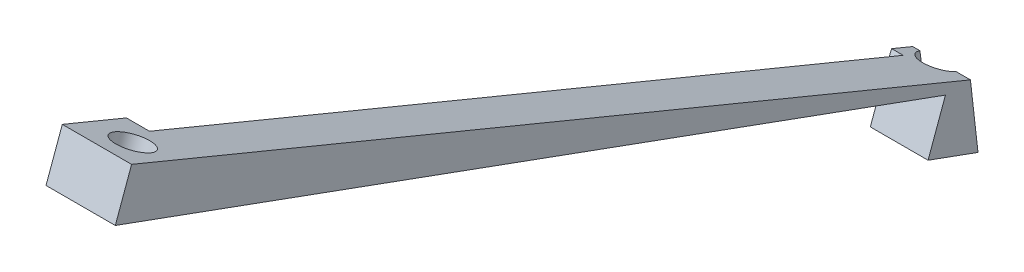
ISO-10303-21;
HEADER;
FILE_DESCRIPTION(('STEP AP214'),'2;1');
FILE_NAME('part.step','',(''),(''),'','','');
FILE_SCHEMA(('AUTOMOTIVE_DESIGN { 1 0 10303 214 1 1 1 1 }'));
ENDSEC;
DATA;
#1=APPLICATION_CONTEXT('core data for automotive mechanical design processes');
#2=APPLICATION_PROTOCOL_DEFINITION('international standard','automotive_design',2000,#1);
#3=PRODUCT_CONTEXT('',#1,'mechanical');
#4=PRODUCT('Part','Part','',(#3));
#5=PRODUCT_RELATED_PRODUCT_CATEGORY('part','',(#4));
#6=PRODUCT_DEFINITION_FORMATION('','',#4);
#7=PRODUCT_DEFINITION_CONTEXT('part definition',#1,'design');
#8=PRODUCT_DEFINITION('design','',#6,#7);
#9=PRODUCT_DEFINITION_SHAPE('','',#8);
#10=(LENGTH_UNIT() NAMED_UNIT(*) SI_UNIT(.MILLI.,.METRE.));
#11=(NAMED_UNIT(*) PLANE_ANGLE_UNIT() SI_UNIT($,.RADIAN.));
#12=(NAMED_UNIT(*) SI_UNIT($,.STERADIAN.) SOLID_ANGLE_UNIT());
#13=UNCERTAINTY_MEASURE_WITH_UNIT(LENGTH_MEASURE(1.E-05),#10,'distance_accuracy_value','');
#14=(GEOMETRIC_REPRESENTATION_CONTEXT(3) GLOBAL_UNCERTAINTY_ASSIGNED_CONTEXT((#13)) GLOBAL_UNIT_ASSIGNED_CONTEXT((#10,
#11,#12)) REPRESENTATION_CONTEXT('',''));
#15=CARTESIAN_POINT('',(0.,0.,0.));
#16=DIRECTION('',(0.,0.,1.));
#17=DIRECTION('',(1.,0.,0.));
#18=AXIS2_PLACEMENT_3D('',#15,#16,#17);
#19=CARTESIAN_POINT('',(8.,-35.7473202159316,-74.6958322749875));
#20=DIRECTION('',(0.,-0.112876155748174,0.993609064704783));
#21=DIRECTION('',(0.,-0.993609064704783,-0.112876155748174));
#22=AXIS2_PLACEMENT_3D('',#19,#20,#21);
#23=PLANE('',#22);
#24=CARTESIAN_POINT('',(2.39421739533138,-24.8225562297524,-73.4547552709423));
#25=DIRECTION('',(0.,-0.112876155748174,0.993609064704783));
#26=DIRECTION('',(0.,0.993609064704783,0.112876155748174));
#27=AXIS2_PLACEMENT_3D('',#24,#25,#26);
#28=ELLIPSE('',#27,7.06417920673511,3.14994015137412);
#29=CARTESIAN_POINT('',(5.53206577291514,-24.2081311688942,-73.3849552446254));
#30=VERTEX_POINT('',#29);
#31=CARTESIAN_POINT('',(4.29539750685049,-30.4189504776165,-74.0905178572445));
#32=VERTEX_POINT('',#31);
#33=EDGE_CURVE('E121',#30,#32,#28,.F.);
#34=ORIENTED_EDGE('',*,*,#33,.F.);
#35=DIRECTION('',(-1.,0.,0.));
#36=VECTOR('',#35,1.);
#37=CARTESIAN_POINT('',(8.,-24.2081311688942,-73.3849552446254));
#38=LINE('',#37,#36);
#39=CARTESIAN_POINT('',(8.,-24.2081311688942,-73.3849552446254));
#40=VERTEX_POINT('',#39);
#41=EDGE_CURVE('E205',#40,#30,#38,.T.);
#42=ORIENTED_EDGE('',*,*,#41,.F.);
#43=DIRECTION('',(0.,0.993609064704783,0.112876155748174));
#44=VECTOR('',#43,1.);
#45=CARTESIAN_POINT('',(8.,-35.7473202159316,-74.6958322749875));
#46=LINE('',#45,#44);
#47=CARTESIAN_POINT('',(8.,-35.7473202159316,-74.6958322749875));
#48=VERTEX_POINT('',#47);
#49=EDGE_CURVE('E191',#48,#40,#46,.T.);
#50=ORIENTED_EDGE('',*,*,#49,.F.);
#51=DIRECTION('',(-1.,0.,0.));
#52=VECTOR('',#51,1.);
#53=CARTESIAN_POINT('',(8.,-35.7473202159316,-74.6958322749875));
#54=LINE('',#53,#52);
#55=CARTESIAN_POINT('',(-2.,-35.7473202159316,-74.6958322749875));
#56=VERTEX_POINT('',#55);
#57=EDGE_CURVE('E207',#48,#56,#54,.T.);
#58=ORIENTED_EDGE('',*,*,#57,.T.);
#59=DIRECTION('',(0.,-0.993609064704783,-0.112876155748174));
#60=VECTOR('',#59,1.);
#61=CARTESIAN_POINT('',(-2.,-25.978642362354,-73.5860891757921));
#62=LINE('',#61,#60);
#63=CARTESIAN_POINT('',(-2.,-24.2081311688942,-73.3849552446254));
#64=VERTEX_POINT('',#63);
#65=EDGE_CURVE('E146',#64,#56,#62,.T.);
#66=ORIENTED_EDGE('',*,*,#65,.F.);
#67=CARTESIAN_POINT('',(-0.743630982252375,-24.2081311688942,-73.3849552446254));
#68=VERTEX_POINT('',#67);
#69=EDGE_CURVE('E204',#68,#64,#38,.T.);
#70=ORIENTED_EDGE('',*,*,#69,.F.);
#71=CARTESIAN_POINT('',(0.493037283812277,-30.4189504776165,-74.0905178572445));
#72=VERTEX_POINT('',#71);
#73=EDGE_CURVE('E49',#72,#68,#28,.F.);
#74=ORIENTED_EDGE('',*,*,#73,.F.);
#75=DIRECTION('',(1.,0.,0.));
#76=VECTOR('',#75,1.);
#77=CARTESIAN_POINT('',(8.,-30.4189504776165,-74.0905178572445));
#78=LINE('',#77,#76);
#79=EDGE_CURVE('E133',#72,#32,#78,.T.);
#80=ORIENTED_EDGE('',*,*,#79,.T.);
#81=EDGE_LOOP('',(#34,#42,#50,#58,#66,#70,#74,#80));
#82=FACE_BOUND('',#81,.T.);
#83=ADVANCED_FACE('F35',(#82),#23,.F.);
#84=CARTESIAN_POINT('',(0.,0.,0.));
#85=DIRECTION('',(-1.,0.,0.));
#86=DIRECTION('',(0.,0.,1.));
#87=AXIS2_PLACEMENT_3D('',#84,#85,#86);
#88=PLANE('',#87);
#89=DIRECTION('',(0.,0.381529725255829,0.924356570132009));
#90=VECTOR('',#89,1.);
#91=CARTESIAN_POINT('',(0.,35.7473202159316,71.8729676226761));
#92=LINE('',#91,#90);
#93=CARTESIAN_POINT('',(0.,-22.7009550134963,-69.7334227705719));
#94=VERTEX_POINT('',#93);
#95=CARTESIAN_POINT('',(0.,31.1648479910877,60.77071784216));
#96=VERTEX_POINT('',#95);
#97=EDGE_CURVE('E57',#94,#96,#92,.T.);
#98=ORIENTED_EDGE('',*,*,#97,.F.);
#99=DIRECTION('',(0.,0.924356570132008,-0.38152972525583));
#100=VECTOR('',#99,1.);
#101=CARTESIAN_POINT('',(0.,-24.3314398344194,-69.0604374250231));
#102=LINE('',#101,#100);
#103=CARTESIAN_POINT('',(0.,-24.3314398344194,-69.0604374250231));
#104=VERTEX_POINT('',#103);
#105=EDGE_CURVE('E145',#104,#94,#102,.T.);
#106=ORIENTED_EDGE('',*,*,#105,.F.);
#107=DIRECTION('',(0.,-0.342020143325673,-0.939692620785907));
#108=VECTOR('',#107,1.);
#109=CARTESIAN_POINT('',(0.,27.9915633255296,74.6958322749875));
#110=LINE('',#109,#108);
#111=CARTESIAN_POINT('',(0.,23.8873216056215,63.4195208255566));
#112=VERTEX_POINT('',#111);
#113=EDGE_CURVE('E183',#112,#104,#110,.T.);
#114=ORIENTED_EDGE('',*,*,#113,.F.);
#115=DIRECTION('',(0.,-0.939692620785906,0.342020143325675));
#116=VECTOR('',#115,1.);
#117=CARTESIAN_POINT('',(0.,23.8873216056215,63.4195208255566));
#118=LINE('',#117,#116);
#119=EDGE_CURVE('E164',#96,#112,#118,.T.);
#120=ORIENTED_EDGE('',*,*,#119,.F.);
#121=EDGE_LOOP('',(#98,#106,#114,#120));
#122=FACE_BOUND('',#121,.T.);
#123=ADVANCED_FACE('F229',(#122),#88,.T.);
#124=CARTESIAN_POINT('',(8.,27.9915633255296,74.6958322749875));
#125=DIRECTION('',(0.,0.939692620785907,-0.342020143325673));
#126=DIRECTION('',(0.,0.342020143325673,0.939692620785907));
#127=AXIS2_PLACEMENT_3D('',#124,#125,#126);
#128=PLANE('',#127);
#129=CARTESIAN_POINT('',(2.39421739533138,25.8438455706848,68.7950262401898));
#130=DIRECTION('',(0.,0.939692620785907,-0.342020143325673));
#131=DIRECTION('',(0.,0.342020143325673,0.939692620785907));
#132=AXIS2_PLACEMENT_3D('',#129,#130,#131);
#133=CIRCLE('',#132,3.14994015137412);
#134=CARTESIAN_POINT('',(2.39421739533138,26.9211885527251,71.7550017563533));
#135=VERTEX_POINT('',#134);
#136=EDGE_CURVE('E134',#135,#135,#133,.F.);
#137=ORIENTED_EDGE('',*,*,#136,.F.);
#138=EDGE_LOOP('',(#137));
#139=FACE_BOUND('',#138,.T.);
#140=DIRECTION('',(-1.,0.,0.));
#141=VECTOR('',#140,1.);
#142=CARTESIAN_POINT('',(8.,27.9915633255296,74.6958322749875));
#143=LINE('',#142,#141);
#144=CARTESIAN_POINT('',(8.,27.9915633255296,74.6958322749875));
#145=VERTEX_POINT('',#144);
#146=CARTESIAN_POINT('',(-4.,27.9915633255296,74.6958322749875));
#147=VERTEX_POINT('',#146);
#148=EDGE_CURVE('E197',#145,#147,#143,.T.);
#149=ORIENTED_EDGE('',*,*,#148,.T.);
#150=DIRECTION('',(0.,0.342020143325673,0.939692620785907));
#151=VECTOR('',#150,1.);
#152=CARTESIAN_POINT('',(-4.,27.9915633255296,74.6958322749875));
#153=LINE('',#152,#151);
#154=CARTESIAN_POINT('',(-4.,23.8873216056215,63.4195208255566));
#155=VERTEX_POINT('',#154);
#156=EDGE_CURVE('E172',#155,#147,#153,.T.);
#157=ORIENTED_EDGE('',*,*,#156,.F.);
#158=DIRECTION('',(1.,0.,0.));
#159=VECTOR('',#158,1.);
#160=CARTESIAN_POINT('',(-4.,23.8873216056215,63.4195208255566));
#161=LINE('',#160,#159);
#162=EDGE_CURVE('E175',#155,#112,#161,.T.);
#163=ORIENTED_EDGE('',*,*,#162,.T.);
#164=ORIENTED_EDGE('',*,*,#113,.T.);
#165=DIRECTION('',(-1.,0.,0.));
#166=VECTOR('',#165,1.);
#167=CARTESIAN_POINT('',(8.,-24.3314398344194,-69.0604374250231));
#168=LINE('',#167,#166);
#169=CARTESIAN_POINT('',(8.,-24.3314398344194,-69.0604374250231));
#170=VERTEX_POINT('',#169);
#171=EDGE_CURVE('E43',#170,#104,#168,.T.);
#172=ORIENTED_EDGE('',*,*,#171,.F.);
#173=DIRECTION('',(0.,-0.342020143325673,-0.939692620785907));
#174=VECTOR('',#173,1.);
#175=CARTESIAN_POINT('',(8.,27.9915633255296,74.6958322749875));
#176=LINE('',#175,#174);
#177=EDGE_CURVE('E184',#145,#170,#176,.T.);
#178=ORIENTED_EDGE('',*,*,#177,.F.);
#179=EDGE_LOOP('',(#149,#157,#163,#164,#172,#178));
#180=FACE_BOUND('',#179,.T.);
#181=ADVANCED_FACE('F37',(#139,#180),#128,.F.);
#182=CARTESIAN_POINT('',(8.,-24.3314398344194,-69.0604374250231));
#183=DIRECTION('',(0.,-0.342020143325683,-0.939692620785903));
#184=DIRECTION('',(0.,0.939692620785903,-0.342020143325683));
#185=AXIS2_PLACEMENT_3D('',#182,#183,#184);
#186=PLANE('',#185);
#187=ORIENTED_EDGE('',*,*,#171,.T.);
#188=DIRECTION('',(1.,0.,0.));
#189=VECTOR('',#188,1.);
#190=CARTESIAN_POINT('',(-2.,-24.3314398344194,-69.0604374250231));
#191=LINE('',#190,#189);
#192=CARTESIAN_POINT('',(-2.,-24.3314398344194,-69.0604374250231));
#193=VERTEX_POINT('',#192);
#194=EDGE_CURVE('E162',#193,#104,#191,.T.);
#195=ORIENTED_EDGE('',*,*,#194,.F.);
#196=DIRECTION('',(0.,0.939692620785903,-0.342020143325683));
#197=VECTOR('',#196,1.);
#198=CARTESIAN_POINT('',(-2.,-32.6007348973353,-66.0506601637571));
#199=LINE('',#198,#197);
#200=CARTESIAN_POINT('',(-2.,-32.6007348973353,-66.0506601637571));
#201=VERTEX_POINT('',#200);
#202=EDGE_CURVE('E152',#201,#193,#199,.T.);
#203=ORIENTED_EDGE('',*,*,#202,.F.);
#204=DIRECTION('',(-1.,0.,0.));
#205=VECTOR('',#204,1.);
#206=CARTESIAN_POINT('',(8.,-32.6007348973353,-66.0506601637571));
#207=LINE('',#206,#205);
#208=CARTESIAN_POINT('',(8.,-32.6007348973353,-66.0506601637571));
#209=VERTEX_POINT('',#208);
#210=EDGE_CURVE('E209',#209,#201,#207,.T.);
#211=ORIENTED_EDGE('',*,*,#210,.F.);
#212=DIRECTION('',(0.,-0.939692620785903,0.342020143325683));
#213=VECTOR('',#212,1.);
#214=CARTESIAN_POINT('',(8.,-24.3314398344194,-69.0604374250231));
#215=LINE('',#214,#213);
#216=EDGE_CURVE('E187',#170,#209,#215,.T.);
#217=ORIENTED_EDGE('',*,*,#216,.F.);
#218=EDGE_LOOP('',(#187,#195,#203,#211,#217));
#219=FACE_BOUND('',#218,.T.);
#220=ADVANCED_FACE('F228',(#219),#186,.F.);
#221=CARTESIAN_POINT('',(8.,-32.6007348973353,-66.0506601637571));
#222=DIRECTION('',(0.,0.939692620785907,-0.342020143325672));
#223=DIRECTION('',(0.,0.342020143325672,0.939692620785907));
#224=AXIS2_PLACEMENT_3D('',#221,#222,#223);
#225=PLANE('',#224);
#226=CARTESIAN_POINT('',(2.39421739533138,-33.8961332877849,-69.6097379907151));
#227=DIRECTION('',(0.,0.939692620785907,-0.342020143325672));
#228=DIRECTION('',(0.,0.342020143325672,0.939692620785907));
#229=AXIS2_PLACEMENT_3D('',#226,#227,#228);
#230=CIRCLE('',#229,1.59999999999999);
#231=CARTESIAN_POINT('',(2.39421739533138,-33.3489010584639,-68.1062297974577));
#232=VERTEX_POINT('',#231);
#233=EDGE_CURVE('E142',#232,#232,#230,.F.);
#234=ORIENTED_EDGE('',*,*,#233,.F.);
#235=EDGE_LOOP('',(#234));
#236=FACE_BOUND('',#235,.T.);
#237=ORIENTED_EDGE('',*,*,#210,.T.);
#238=DIRECTION('',(0.,0.342020143325672,0.939692620785907));
#239=VECTOR('',#238,1.);
#240=CARTESIAN_POINT('',(-2.,-35.7473202159316,-74.6958322749875));
#241=LINE('',#240,#239);
#242=EDGE_CURVE('E149',#56,#201,#241,.T.);
#243=ORIENTED_EDGE('',*,*,#242,.F.);
#244=ORIENTED_EDGE('',*,*,#57,.F.);
#245=DIRECTION('',(0.,-0.342020143325672,-0.939692620785907));
#246=VECTOR('',#245,1.);
#247=CARTESIAN_POINT('',(8.,-32.6007348973353,-66.0506601637571));
#248=LINE('',#247,#246);
#249=EDGE_CURVE('E189',#209,#48,#248,.T.);
#250=ORIENTED_EDGE('',*,*,#249,.F.);
#251=EDGE_LOOP('',(#237,#243,#244,#250));
#252=FACE_BOUND('',#251,.T.);
#253=ADVANCED_FACE('F262',(#236,#252),#225,.F.);
#254=CARTESIAN_POINT('',(8.,35.7473202159316,71.8729676226761));
#255=DIRECTION('',(0.,-0.924356570132009,0.381529725255829));
#256=DIRECTION('',(0.,-0.381529725255829,-0.924356570132009));
#257=AXIS2_PLACEMENT_3D('',#254,#255,#256);
#258=PLANE('',#257);
#259=CARTESIAN_POINT('',(2.39421739533138,-24.3134273367449,-73.6400630334019));
#260=DIRECTION('',(0.,-0.924356570132009,0.381529725255829));
#261=DIRECTION('',(0.,0.381529725255829,0.924356570132009));
#262=AXIS2_PLACEMENT_3D('',#259,#260,#261);
#263=ELLIPSE('',#262,3.15277165798673,3.14994015137412);
#264=EDGE_CURVE('E11',#68,#30,#263,.F.);
#265=ORIENTED_EDGE('',*,*,#264,.F.);
#266=ORIENTED_EDGE('',*,*,#69,.T.);
#267=DIRECTION('',(0.,-0.381529725255829,-0.924356570132009));
#268=VECTOR('',#267,1.);
#269=CARTESIAN_POINT('',(-2.,-22.7009550134963,-69.7334227705719));
#270=LINE('',#269,#268);
#271=CARTESIAN_POINT('',(-2.,-22.7009550134963,-69.7334227705719));
#272=VERTEX_POINT('',#271);
#273=EDGE_CURVE('E156',#272,#64,#270,.T.);
#274=ORIENTED_EDGE('',*,*,#273,.F.);
#275=DIRECTION('',(1.,0.,0.));
#276=VECTOR('',#275,1.);
#277=CARTESIAN_POINT('',(-2.,-22.7009550134963,-69.7334227705719));
#278=LINE('',#277,#276);
#279=EDGE_CURVE('E159',#272,#94,#278,.T.);
#280=ORIENTED_EDGE('',*,*,#279,.T.);
#281=ORIENTED_EDGE('',*,*,#97,.T.);
#282=DIRECTION('',(1.,0.,0.));
#283=VECTOR('',#282,1.);
#284=CARTESIAN_POINT('',(-4.,31.1648479910877,60.77071784216));
#285=LINE('',#284,#283);
#286=CARTESIAN_POINT('',(-4.,31.1648479910877,60.77071784216));
#287=VERTEX_POINT('',#286);
#288=EDGE_CURVE('E180',#287,#96,#285,.T.);
#289=ORIENTED_EDGE('',*,*,#288,.F.);
#290=DIRECTION('',(0.,-0.381529725255829,-0.924356570132009));
#291=VECTOR('',#290,1.);
#292=CARTESIAN_POINT('',(-4.,31.1648479910877,60.77071784216));
#293=LINE('',#292,#291);
#294=CARTESIAN_POINT('',(-4.,35.7473202159316,71.8729676226761));
#295=VERTEX_POINT('',#294);
#296=EDGE_CURVE('E168',#295,#287,#293,.T.);
#297=ORIENTED_EDGE('',*,*,#296,.F.);
#298=DIRECTION('',(-1.,0.,0.));
#299=VECTOR('',#298,1.);
#300=CARTESIAN_POINT('',(8.,35.7473202159316,71.8729676226761));
#301=LINE('',#300,#299);
#302=CARTESIAN_POINT('',(8.,35.7473202159316,71.8729676226761));
#303=VERTEX_POINT('',#302);
#304=EDGE_CURVE('E202',#303,#295,#301,.T.);
#305=ORIENTED_EDGE('',*,*,#304,.F.);
#306=DIRECTION('',(0.,0.381529725255829,0.924356570132009));
#307=VECTOR('',#306,1.);
#308=CARTESIAN_POINT('',(8.,35.7473202159316,71.8729676226761));
#309=LINE('',#308,#307);
#310=EDGE_CURVE('E193',#40,#303,#309,.T.);
#311=ORIENTED_EDGE('',*,*,#310,.F.);
#312=ORIENTED_EDGE('',*,*,#41,.T.);
#313=EDGE_LOOP('',(#265,#266,#274,#280,#281,#289,#297,#305,#311,#312));
#314=FACE_BOUND('',#313,.T.);
#315=CARTESIAN_POINT('',(2.39421739533138,33.3493481592076,66.0632467047595));
#316=DIRECTION('',(0.,-0.924356570132009,0.381529725255829));
#317=DIRECTION('',(0.,-0.381529725255829,-0.924356570132009));
#318=AXIS2_PLACEMENT_3D('',#315,#316,#317);
#319=ELLIPSE('',#318,3.15277165798673,3.14994015137412);
#320=CARTESIAN_POINT('',(2.39421739533138,32.1464720547416,63.1489615085735));
#321=VERTEX_POINT('',#320);
#322=EDGE_CURVE('E129',#321,#321,#319,.T.);
#323=ORIENTED_EDGE('',*,*,#322,.T.);
#324=EDGE_LOOP('',(#323));
#325=FACE_BOUND('',#324,.T.);
#326=ADVANCED_FACE('F216',(#314,#325),#258,.F.);
#327=CARTESIAN_POINT('',(8.,27.9915633255296,74.6958322749875));
#328=DIRECTION('',(0.,-0.342020143325675,-0.939692620785906));
#329=DIRECTION('',(0.,0.939692620785906,-0.342020143325675));
#330=AXIS2_PLACEMENT_3D('',#327,#328,#329);
#331=PLANE('',#330);
#332=ORIENTED_EDGE('',*,*,#304,.T.);
#333=DIRECTION('',(0.,0.939692620785906,-0.342020143325675));
#334=VECTOR('',#333,1.);
#335=CARTESIAN_POINT('',(-4.,27.9915633255296,74.6958322749875));
#336=LINE('',#335,#334);
#337=EDGE_CURVE('E165',#147,#295,#336,.T.);
#338=ORIENTED_EDGE('',*,*,#337,.F.);
#339=ORIENTED_EDGE('',*,*,#148,.F.);
#340=DIRECTION('',(0.,-0.939692620785906,0.342020143325675));
#341=VECTOR('',#340,1.);
#342=CARTESIAN_POINT('',(8.,27.9915633255296,74.6958322749875));
#343=LINE('',#342,#341);
#344=EDGE_CURVE('E195',#303,#145,#343,.T.);
#345=ORIENTED_EDGE('',*,*,#344,.F.);
#346=EDGE_LOOP('',(#332,#338,#339,#345));
#347=FACE_BOUND('',#346,.T.);
#348=ADVANCED_FACE('F241',(#347),#331,.F.);
#349=CARTESIAN_POINT('',(8.,0.,0.));
#350=DIRECTION('',(-1.,0.,0.));
#351=DIRECTION('',(0.,0.,1.));
#352=AXIS2_PLACEMENT_3D('',#349,#350,#351);
#353=PLANE('',#352);
#354=ORIENTED_EDGE('',*,*,#177,.T.);
#355=ORIENTED_EDGE('',*,*,#216,.T.);
#356=ORIENTED_EDGE('',*,*,#249,.T.);
#357=ORIENTED_EDGE('',*,*,#49,.T.);
#358=ORIENTED_EDGE('',*,*,#310,.T.);
#359=ORIENTED_EDGE('',*,*,#344,.T.);
#360=EDGE_LOOP('',(#354,#355,#356,#357,#358,#359));
#361=FACE_BOUND('',#360,.T.);
#362=ADVANCED_FACE('F256',(#361),#353,.F.);
#363=CARTESIAN_POINT('',(-4.,23.8873216056215,63.4195208255566));
#364=DIRECTION('',(0.,0.342020143325675,0.939692620785906));
#365=DIRECTION('',(0.,-0.939692620785906,0.342020143325675));
#366=AXIS2_PLACEMENT_3D('',#363,#364,#365);
#367=PLANE('',#366);
#368=ORIENTED_EDGE('',*,*,#119,.T.);
#369=ORIENTED_EDGE('',*,*,#162,.F.);
#370=DIRECTION('',(0.,-0.939692620785906,0.342020143325675));
#371=VECTOR('',#370,1.);
#372=CARTESIAN_POINT('',(-4.,23.8873216056215,63.4195208255566));
#373=LINE('',#372,#371);
#374=EDGE_CURVE('E170',#287,#155,#373,.T.);
#375=ORIENTED_EDGE('',*,*,#374,.F.);
#376=ORIENTED_EDGE('',*,*,#288,.T.);
#377=EDGE_LOOP('',(#368,#369,#375,#376));
#378=FACE_BOUND('',#377,.T.);
#379=ADVANCED_FACE('F246',(#378),#367,.F.);
#380=CARTESIAN_POINT('',(-4.,0.,0.));
#381=DIRECTION('',(-1.,0.,0.));
#382=DIRECTION('',(0.,0.,1.));
#383=AXIS2_PLACEMENT_3D('',#380,#381,#382);
#384=PLANE('',#383);
#385=ORIENTED_EDGE('',*,*,#337,.T.);
#386=ORIENTED_EDGE('',*,*,#296,.T.);
#387=ORIENTED_EDGE('',*,*,#374,.T.);
#388=ORIENTED_EDGE('',*,*,#156,.T.);
#389=EDGE_LOOP('',(#385,#386,#387,#388));
#390=FACE_BOUND('',#389,.T.);
#391=ADVANCED_FACE('F238',(#390),#384,.T.);
#392=CARTESIAN_POINT('',(-2.,-24.3314398344194,-69.0604374250231));
#393=DIRECTION('',(0.,-0.38152972525583,-0.924356570132009));
#394=DIRECTION('',(0.,0.924356570132008,-0.38152972525583));
#395=AXIS2_PLACEMENT_3D('',#392,#393,#394);
#396=PLANE('',#395);
#397=ORIENTED_EDGE('',*,*,#105,.T.);
#398=ORIENTED_EDGE('',*,*,#279,.F.);
#399=DIRECTION('',(0.,0.924356570132008,-0.38152972525583));
#400=VECTOR('',#399,1.);
#401=CARTESIAN_POINT('',(-2.,-24.3314398344194,-69.0604374250231));
#402=LINE('',#401,#400);
#403=EDGE_CURVE('E154',#193,#272,#402,.T.);
#404=ORIENTED_EDGE('',*,*,#403,.F.);
#405=ORIENTED_EDGE('',*,*,#194,.T.);
#406=EDGE_LOOP('',(#397,#398,#404,#405));
#407=FACE_BOUND('',#406,.T.);
#408=ADVANCED_FACE('F268',(#407),#396,.F.);
#409=CARTESIAN_POINT('',(-2.,0.,0.));
#410=DIRECTION('',(-1.,0.,0.));
#411=DIRECTION('',(0.,0.,1.));
#412=AXIS2_PLACEMENT_3D('',#409,#410,#411);
#413=PLANE('',#412);
#414=ORIENTED_EDGE('',*,*,#65,.T.);
#415=ORIENTED_EDGE('',*,*,#242,.T.);
#416=ORIENTED_EDGE('',*,*,#202,.T.);
#417=ORIENTED_EDGE('',*,*,#403,.T.);
#418=ORIENTED_EDGE('',*,*,#273,.T.);
#419=EDGE_LOOP('',(#414,#415,#416,#417,#418));
#420=FACE_BOUND('',#419,.T.);
#421=ADVANCED_FACE('F264',(#420),#413,.T.);
#422=CARTESIAN_POINT('',(2.39421739533138,-36.9031496742998,-68.515273532073));
#423=DIRECTION('',(0.,0.939692620785907,-0.342020143325673));
#424=DIRECTION('',(0.,0.342020143325673,0.939692620785907));
#425=AXIS2_PLACEMENT_3D('',#422,#423,#424);
#426=CYLINDRICAL_SURFACE('',#425,1.59999999999999);
#427=CARTESIAN_POINT('',(2.39421739533138,-29.3856087080126,-71.2514346786784));
#428=DIRECTION('',(0.,-0.939692620785907,0.342020143325673));
#429=DIRECTION('',(0.,-0.342020143325673,-0.939692620785907));
#430=AXIS2_PLACEMENT_3D('',#427,#428,#429);
#431=CIRCLE('',#430,1.59999999999999);
#432=CARTESIAN_POINT('',(2.39421739533138,-29.9328409373336,-72.7549428719358));
#433=VERTEX_POINT('',#432);
#434=EDGE_CURVE('E137',#433,#433,#431,.T.);
#435=ORIENTED_EDGE('',*,*,#434,.F.);
#436=EDGE_LOOP('',(#435));
#437=FACE_BOUND('',#436,.T.);
#438=ORIENTED_EDGE('',*,*,#233,.T.);
#439=EDGE_LOOP('',(#438));
#440=FACE_BOUND('',#439,.T.);
#441=ADVANCED_FACE('F221',(#437,#440),#426,.F.);
#442=CARTESIAN_POINT('',(2.39421739533138,39.9392348824734,63.6647240903047));
#443=DIRECTION('',(0.,-0.939692620785907,0.342020143325673));
#444=DIRECTION('',(0.,-0.342020143325673,-0.939692620785907));
#445=AXIS2_PLACEMENT_3D('',#442,#443,#444);
#446=CYLINDRICAL_SURFACE('',#445,3.14994015137412);
#447=ORIENTED_EDGE('',*,*,#322,.F.);
#448=EDGE_LOOP('',(#447));
#449=FACE_BOUND('',#448,.T.);
#450=ORIENTED_EDGE('',*,*,#136,.T.);
#451=EDGE_LOOP('',(#450));
#452=FACE_BOUND('',#451,.T.);
#453=ADVANCED_FACE('F218',(#449,#452),#446,.F.);
#454=CARTESIAN_POINT('',(2.39421739533138,-29.5599665546354,-71.7304789251794));
#455=DIRECTION('',(0.,0.939692620785907,-0.342020143325673));
#456=DIRECTION('',(0.,0.342020143325673,0.939692620785907));
#457=AXIS2_PLACEMENT_3D('',#454,#455,#456);
#458=CYLINDRICAL_SURFACE('',#457,3.14994015137412);
#459=ORIENTED_EDGE('',*,*,#33,.T.);
#460=CARTESIAN_POINT('',(2.39421739533138,-29.5599665546354,-71.7304789251794));
#461=DIRECTION('',(0.,-0.939692620785907,0.342020143325673));
#462=DIRECTION('',(0.,-0.342020143325673,-0.939692620785907));
#463=AXIS2_PLACEMENT_3D('',#460,#461,#462);
#464=CIRCLE('',#463,3.14994015137412);
#465=EDGE_CURVE('E124',#32,#72,#464,.T.);
#466=ORIENTED_EDGE('',*,*,#465,.T.);
#467=ORIENTED_EDGE('',*,*,#73,.T.);
#468=ORIENTED_EDGE('',*,*,#264,.T.);
#469=EDGE_LOOP('',(#459,#466,#467,#468));
#470=FACE_BOUND('',#469,.T.);
#471=ADVANCED_FACE('F123',(#470),#458,.F.);
#472=CARTESIAN_POINT('',(2.39421739533138,-29.5599665546354,-71.7304789251794));
#473=DIRECTION('',(0.,-0.939692620785907,0.342020143325673));
#474=DIRECTION('',(0.,-0.342020143325673,-0.939692620785907));
#475=AXIS2_PLACEMENT_3D('',#472,#473,#474);
#476=PLANE('',#475);
#477=ORIENTED_EDGE('',*,*,#434,.T.);
#478=EDGE_LOOP('',(#477));
#479=FACE_BOUND('',#478,.T.);
#480=ORIENTED_EDGE('',*,*,#465,.F.);
#481=ORIENTED_EDGE('',*,*,#79,.F.);
#482=EDGE_LOOP('',(#480,#481));
#483=FACE_BOUND('',#482,.T.);
#484=ADVANCED_FACE('F132',(#479,#483),#476,.F.);
#485=CLOSED_SHELL('',(#83,#123,#181,#220,#253,#326,#348,#362,#379,#391,#408,#421,#441,#453,#471,#484));
#486=MANIFOLD_SOLID_BREP('B2',#485);
#487=ADVANCED_BREP_SHAPE_REPRESENTATION('',(#18,#486),#14);
#488=SHAPE_DEFINITION_REPRESENTATION(#9,#487);
ENDSEC;
END-ISO-10303-21;
